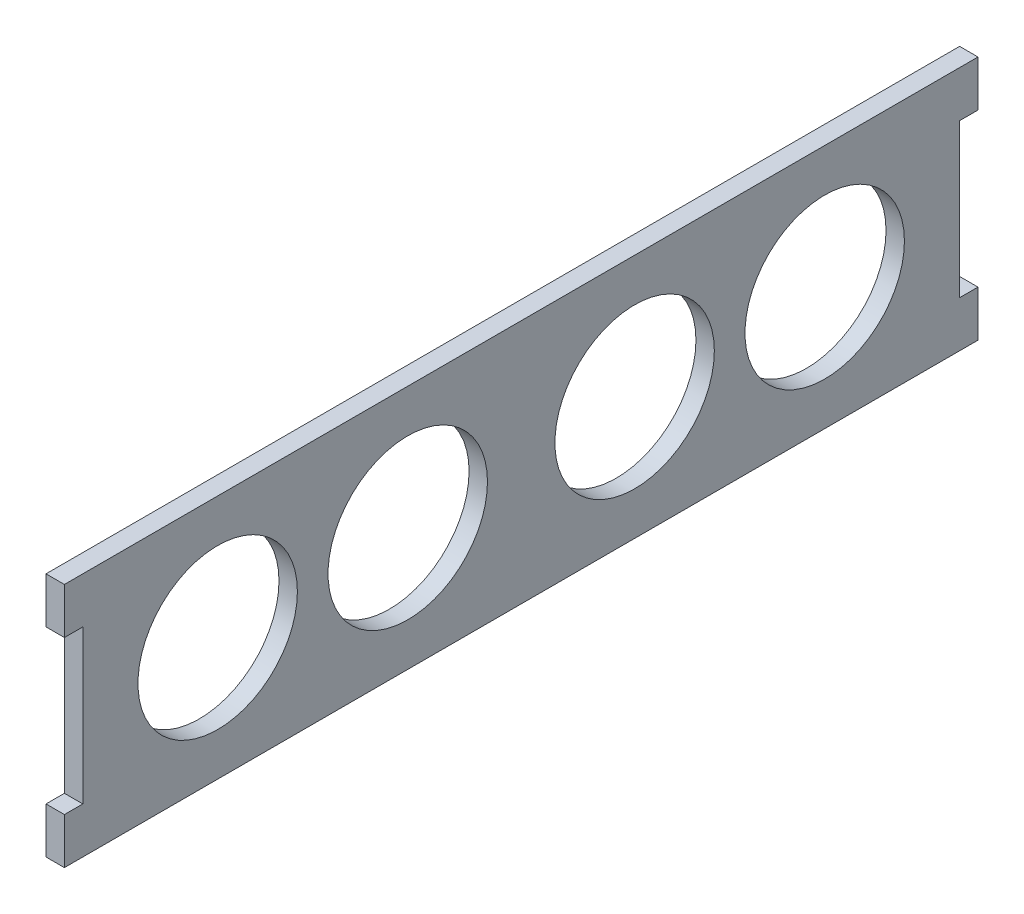
ISO-10303-21;
HEADER;
FILE_DESCRIPTION(('STEP AP214'),'2;1');
FILE_NAME('part.step','',(''),(''),'','','');
FILE_SCHEMA(('AUTOMOTIVE_DESIGN { 1 0 10303 214 1 1 1 1 }'));
ENDSEC;
DATA;
#1=APPLICATION_CONTEXT('core data for automotive mechanical design processes');
#2=APPLICATION_PROTOCOL_DEFINITION('international standard','automotive_design',2000,#1);
#3=PRODUCT_CONTEXT('',#1,'mechanical');
#4=PRODUCT('Part','Part','',(#3));
#5=PRODUCT_RELATED_PRODUCT_CATEGORY('part','',(#4));
#6=PRODUCT_DEFINITION_FORMATION('','',#4);
#7=PRODUCT_DEFINITION_CONTEXT('part definition',#1,'design');
#8=PRODUCT_DEFINITION('design','',#6,#7);
#9=PRODUCT_DEFINITION_SHAPE('','',#8);
#10=(LENGTH_UNIT() NAMED_UNIT(*) SI_UNIT(.MILLI.,.METRE.));
#11=(NAMED_UNIT(*) PLANE_ANGLE_UNIT() SI_UNIT($,.RADIAN.));
#12=(NAMED_UNIT(*) SI_UNIT($,.STERADIAN.) SOLID_ANGLE_UNIT());
#13=UNCERTAINTY_MEASURE_WITH_UNIT(LENGTH_MEASURE(1.E-05),#10,'distance_accuracy_value','');
#14=(GEOMETRIC_REPRESENTATION_CONTEXT(3) GLOBAL_UNCERTAINTY_ASSIGNED_CONTEXT((#13)) GLOBAL_UNIT_ASSIGNED_CONTEXT((#10,
#11,#12)) REPRESENTATION_CONTEXT('',''));
#15=CARTESIAN_POINT('',(0.,0.,0.));
#16=DIRECTION('',(0.,0.,1.));
#17=DIRECTION('',(1.,0.,0.));
#18=AXIS2_PLACEMENT_3D('',#15,#16,#17);
#19=CARTESIAN_POINT('',(3.,0.,71.5));
#20=DIRECTION('',(0.,0.,-1.));
#21=DIRECTION('',(-1.,0.,0.));
#22=AXIS2_PLACEMENT_3D('',#19,#20,#21);
#23=PLANE('',#22);
#24=DIRECTION('',(0.,-1.,0.));
#25=VECTOR('',#24,1.);
#26=CARTESIAN_POINT('',(0.,0.,71.5));
#27=LINE('',#26,#25);
#28=CARTESIAN_POINT('',(0.,12.5,71.5));
#29=VERTEX_POINT('',#28);
#30=CARTESIAN_POINT('',(0.,-12.5,71.5));
#31=VERTEX_POINT('',#30);
#32=EDGE_CURVE('E183',#29,#31,#27,.T.);
#33=ORIENTED_EDGE('',*,*,#32,.T.);
#34=DIRECTION('',(-1.,0.,0.));
#35=VECTOR('',#34,1.);
#36=CARTESIAN_POINT('',(3.,-12.5,71.5));
#37=LINE('',#36,#35);
#38=CARTESIAN_POINT('',(3.,-12.5,71.5));
#39=VERTEX_POINT('',#38);
#40=EDGE_CURVE('E11',#39,#31,#37,.T.);
#41=ORIENTED_EDGE('',*,*,#40,.F.);
#42=DIRECTION('',(0.,-1.,0.));
#43=VECTOR('',#42,1.);
#44=CARTESIAN_POINT('',(3.,0.,71.5));
#45=LINE('',#44,#43);
#46=CARTESIAN_POINT('',(3.,12.5,71.5));
#47=VERTEX_POINT('',#46);
#48=EDGE_CURVE('E108',#47,#39,#45,.T.);
#49=ORIENTED_EDGE('',*,*,#48,.F.);
#50=DIRECTION('',(-1.,0.,0.));
#51=VECTOR('',#50,1.);
#52=CARTESIAN_POINT('',(3.,12.5,71.5));
#53=LINE('',#52,#51);
#54=EDGE_CURVE('E166',#47,#29,#53,.T.);
#55=ORIENTED_EDGE('',*,*,#54,.T.);
#56=EDGE_LOOP('',(#33,#41,#49,#55));
#57=FACE_BOUND('',#56,.T.);
#58=ADVANCED_FACE('F39',(#57),#23,.F.);
#59=CARTESIAN_POINT('',(3.,-12.5,0.));
#60=DIRECTION('',(0.,1.,0.));
#61=DIRECTION('',(0.,0.,1.));
#62=AXIS2_PLACEMENT_3D('',#59,#60,#61);
#63=PLANE('',#62);
#64=DIRECTION('',(0.,0.,-1.));
#65=VECTOR('',#64,1.);
#66=CARTESIAN_POINT('',(0.,-12.5,0.));
#67=LINE('',#66,#65);
#68=CARTESIAN_POINT('',(0.,-12.5,74.5));
#69=VERTEX_POINT('',#68);
#70=EDGE_CURVE('E187',#69,#31,#67,.T.);
#71=ORIENTED_EDGE('',*,*,#70,.F.);
#72=DIRECTION('',(-1.,0.,0.));
#73=VECTOR('',#72,1.);
#74=CARTESIAN_POINT('',(3.,-12.5,74.5));
#75=LINE('',#74,#73);
#76=CARTESIAN_POINT('',(3.,-12.5,74.5));
#77=VERTEX_POINT('',#76);
#78=EDGE_CURVE('E49',#77,#69,#75,.T.);
#79=ORIENTED_EDGE('',*,*,#78,.F.);
#80=DIRECTION('',(0.,0.,-1.));
#81=VECTOR('',#80,1.);
#82=CARTESIAN_POINT('',(3.,-12.5,0.));
#83=LINE('',#82,#81);
#84=EDGE_CURVE('E264',#77,#39,#83,.T.);
#85=ORIENTED_EDGE('',*,*,#84,.T.);
#86=ORIENTED_EDGE('',*,*,#40,.T.);
#87=EDGE_LOOP('',(#71,#79,#85,#86));
#88=FACE_BOUND('',#87,.T.);
#89=ADVANCED_FACE('F263',(#88),#63,.T.);
#90=CARTESIAN_POINT('',(3.,0.,74.5));
#91=DIRECTION('',(0.,0.,-1.));
#92=DIRECTION('',(-1.,0.,0.));
#93=AXIS2_PLACEMENT_3D('',#90,#91,#92);
#94=PLANE('',#93);
#95=DIRECTION('',(0.,-1.,0.));
#96=VECTOR('',#95,1.);
#97=CARTESIAN_POINT('',(0.,0.,74.5));
#98=LINE('',#97,#96);
#99=CARTESIAN_POINT('',(0.,-20.,74.5));
#100=VERTEX_POINT('',#99);
#101=EDGE_CURVE('E191',#69,#100,#98,.T.);
#102=ORIENTED_EDGE('',*,*,#101,.T.);
#103=DIRECTION('',(-1.,0.,0.));
#104=VECTOR('',#103,1.);
#105=CARTESIAN_POINT('',(3.,-20.,74.5));
#106=LINE('',#105,#104);
#107=CARTESIAN_POINT('',(3.,-20.,74.5));
#108=VERTEX_POINT('',#107);
#109=EDGE_CURVE('E246',#108,#100,#106,.T.);
#110=ORIENTED_EDGE('',*,*,#109,.F.);
#111=DIRECTION('',(0.,-1.,0.));
#112=VECTOR('',#111,1.);
#113=CARTESIAN_POINT('',(3.,0.,74.5));
#114=LINE('',#113,#112);
#115=EDGE_CURVE('E255',#77,#108,#114,.T.);
#116=ORIENTED_EDGE('',*,*,#115,.F.);
#117=ORIENTED_EDGE('',*,*,#78,.T.);
#118=EDGE_LOOP('',(#102,#110,#116,#117));
#119=FACE_BOUND('',#118,.T.);
#120=ADVANCED_FACE('F253',(#119),#94,.F.);
#121=CARTESIAN_POINT('',(3.,-20.,0.));
#122=DIRECTION('',(0.,1.,0.));
#123=DIRECTION('',(0.,0.,1.));
#124=AXIS2_PLACEMENT_3D('',#121,#122,#123);
#125=PLANE('',#124);
#126=DIRECTION('',(0.,0.,-1.));
#127=VECTOR('',#126,1.);
#128=CARTESIAN_POINT('',(0.,-20.,0.));
#129=LINE('',#128,#127);
#130=CARTESIAN_POINT('',(0.,-20.,-74.5));
#131=VERTEX_POINT('',#130);
#132=EDGE_CURVE('E194',#100,#131,#129,.T.);
#133=ORIENTED_EDGE('',*,*,#132,.T.);
#134=DIRECTION('',(-1.,0.,0.));
#135=VECTOR('',#134,1.);
#136=CARTESIAN_POINT('',(3.,-20.,-74.5));
#137=LINE('',#136,#135);
#138=CARTESIAN_POINT('',(3.,-20.,-74.5));
#139=VERTEX_POINT('',#138);
#140=EDGE_CURVE('E243',#139,#131,#137,.T.);
#141=ORIENTED_EDGE('',*,*,#140,.F.);
#142=DIRECTION('',(0.,0.,-1.));
#143=VECTOR('',#142,1.);
#144=CARTESIAN_POINT('',(3.,-20.,0.));
#145=LINE('',#144,#143);
#146=EDGE_CURVE('E292',#108,#139,#145,.T.);
#147=ORIENTED_EDGE('',*,*,#146,.F.);
#148=ORIENTED_EDGE('',*,*,#109,.T.);
#149=EDGE_LOOP('',(#133,#141,#147,#148));
#150=FACE_BOUND('',#149,.T.);
#151=ADVANCED_FACE('F291',(#150),#125,.F.);
#152=CARTESIAN_POINT('',(3.,0.,-74.5));
#153=DIRECTION('',(0.,0.,-1.));
#154=DIRECTION('',(-1.,0.,0.));
#155=AXIS2_PLACEMENT_3D('',#152,#153,#154);
#156=PLANE('',#155);
#157=DIRECTION('',(0.,-1.,0.));
#158=VECTOR('',#157,1.);
#159=CARTESIAN_POINT('',(0.,0.,-74.5));
#160=LINE('',#159,#158);
#161=CARTESIAN_POINT('',(0.,-12.5,-74.5));
#162=VERTEX_POINT('',#161);
#163=EDGE_CURVE('E198',#162,#131,#160,.T.);
#164=ORIENTED_EDGE('',*,*,#163,.F.);
#165=DIRECTION('',(-1.,0.,0.));
#166=VECTOR('',#165,1.);
#167=CARTESIAN_POINT('',(3.,-12.5,-74.5));
#168=LINE('',#167,#166);
#169=CARTESIAN_POINT('',(3.,-12.5,-74.5));
#170=VERTEX_POINT('',#169);
#171=EDGE_CURVE('E240',#170,#162,#168,.T.);
#172=ORIENTED_EDGE('',*,*,#171,.F.);
#173=DIRECTION('',(0.,-1.,0.));
#174=VECTOR('',#173,1.);
#175=CARTESIAN_POINT('',(3.,0.,-74.5));
#176=LINE('',#175,#174);
#177=EDGE_CURVE('E288',#170,#139,#176,.T.);
#178=ORIENTED_EDGE('',*,*,#177,.T.);
#179=ORIENTED_EDGE('',*,*,#140,.T.);
#180=EDGE_LOOP('',(#164,#172,#178,#179));
#181=FACE_BOUND('',#180,.T.);
#182=ADVANCED_FACE('F283',(#181),#156,.T.);
#183=CARTESIAN_POINT('',(3.,-12.5,0.));
#184=DIRECTION('',(0.,-1.,0.));
#185=DIRECTION('',(0.,0.,-1.));
#186=AXIS2_PLACEMENT_3D('',#183,#184,#185);
#187=PLANE('',#186);
#188=DIRECTION('',(0.,0.,1.));
#189=VECTOR('',#188,1.);
#190=CARTESIAN_POINT('',(0.,-12.5,0.));
#191=LINE('',#190,#189);
#192=CARTESIAN_POINT('',(0.,-12.5,-71.5));
#193=VERTEX_POINT('',#192);
#194=EDGE_CURVE('E202',#162,#193,#191,.T.);
#195=ORIENTED_EDGE('',*,*,#194,.T.);
#196=DIRECTION('',(-1.,0.,0.));
#197=VECTOR('',#196,1.);
#198=CARTESIAN_POINT('',(3.,-12.5,-71.5));
#199=LINE('',#198,#197);
#200=CARTESIAN_POINT('',(3.,-12.5,-71.5));
#201=VERTEX_POINT('',#200);
#202=EDGE_CURVE('E237',#201,#193,#199,.T.);
#203=ORIENTED_EDGE('',*,*,#202,.F.);
#204=DIRECTION('',(0.,0.,1.));
#205=VECTOR('',#204,1.);
#206=CARTESIAN_POINT('',(3.,-12.5,0.));
#207=LINE('',#206,#205);
#208=EDGE_CURVE('E297',#170,#201,#207,.T.);
#209=ORIENTED_EDGE('',*,*,#208,.F.);
#210=ORIENTED_EDGE('',*,*,#171,.T.);
#211=EDGE_LOOP('',(#195,#203,#209,#210));
#212=FACE_BOUND('',#211,.T.);
#213=ADVANCED_FACE('F307',(#212),#187,.F.);
#214=CARTESIAN_POINT('',(3.,0.,-71.5));
#215=DIRECTION('',(0.,0.,-1.));
#216=DIRECTION('',(-1.,0.,0.));
#217=AXIS2_PLACEMENT_3D('',#214,#215,#216);
#218=PLANE('',#217);
#219=DIRECTION('',(0.,-1.,0.));
#220=VECTOR('',#219,1.);
#221=CARTESIAN_POINT('',(0.,0.,-71.5));
#222=LINE('',#221,#220);
#223=CARTESIAN_POINT('',(0.,12.5,-71.5));
#224=VERTEX_POINT('',#223);
#225=EDGE_CURVE('E206',#224,#193,#222,.T.);
#226=ORIENTED_EDGE('',*,*,#225,.F.);
#227=DIRECTION('',(-1.,0.,0.));
#228=VECTOR('',#227,1.);
#229=CARTESIAN_POINT('',(3.,12.5,-71.5));
#230=LINE('',#229,#228);
#231=CARTESIAN_POINT('',(3.,12.5,-71.5));
#232=VERTEX_POINT('',#231);
#233=EDGE_CURVE('E234',#232,#224,#230,.T.);
#234=ORIENTED_EDGE('',*,*,#233,.F.);
#235=DIRECTION('',(0.,-1.,0.));
#236=VECTOR('',#235,1.);
#237=CARTESIAN_POINT('',(3.,0.,-71.5));
#238=LINE('',#237,#236);
#239=EDGE_CURVE('E304',#232,#201,#238,.T.);
#240=ORIENTED_EDGE('',*,*,#239,.T.);
#241=ORIENTED_EDGE('',*,*,#202,.T.);
#242=EDGE_LOOP('',(#226,#234,#240,#241));
#243=FACE_BOUND('',#242,.T.);
#244=ADVANCED_FACE('F277',(#243),#218,.T.);
#245=CARTESIAN_POINT('',(3.,12.5,0.));
#246=DIRECTION('',(0.,-1.,0.));
#247=DIRECTION('',(0.,0.,-1.));
#248=AXIS2_PLACEMENT_3D('',#245,#246,#247);
#249=PLANE('',#248);
#250=DIRECTION('',(0.,0.,1.));
#251=VECTOR('',#250,1.);
#252=CARTESIAN_POINT('',(0.,12.5,0.));
#253=LINE('',#252,#251);
#254=CARTESIAN_POINT('',(0.,12.5,-74.5));
#255=VERTEX_POINT('',#254);
#256=EDGE_CURVE('E210',#255,#224,#253,.T.);
#257=ORIENTED_EDGE('',*,*,#256,.F.);
#258=DIRECTION('',(-1.,0.,0.));
#259=VECTOR('',#258,1.);
#260=CARTESIAN_POINT('',(3.,12.5,-74.5));
#261=LINE('',#260,#259);
#262=CARTESIAN_POINT('',(3.,12.5,-74.5));
#263=VERTEX_POINT('',#262);
#264=EDGE_CURVE('E231',#263,#255,#261,.T.);
#265=ORIENTED_EDGE('',*,*,#264,.F.);
#266=DIRECTION('',(0.,0.,1.));
#267=VECTOR('',#266,1.);
#268=CARTESIAN_POINT('',(3.,12.5,0.));
#269=LINE('',#268,#267);
#270=EDGE_CURVE('E160',#263,#232,#269,.T.);
#271=ORIENTED_EDGE('',*,*,#270,.T.);
#272=ORIENTED_EDGE('',*,*,#233,.T.);
#273=EDGE_LOOP('',(#257,#265,#271,#272));
#274=FACE_BOUND('',#273,.T.);
#275=ADVANCED_FACE('F272',(#274),#249,.T.);
#276=CARTESIAN_POINT('',(3.,0.,-74.5));
#277=DIRECTION('',(0.,0.,-1.));
#278=DIRECTION('',(-1.,0.,0.));
#279=AXIS2_PLACEMENT_3D('',#276,#277,#278);
#280=PLANE('',#279);
#281=DIRECTION('',(0.,-1.,0.));
#282=VECTOR('',#281,1.);
#283=CARTESIAN_POINT('',(0.,0.,-74.5));
#284=LINE('',#283,#282);
#285=CARTESIAN_POINT('',(0.,20.,-74.5));
#286=VERTEX_POINT('',#285);
#287=EDGE_CURVE('E214',#286,#255,#284,.T.);
#288=ORIENTED_EDGE('',*,*,#287,.F.);
#289=DIRECTION('',(-1.,0.,0.));
#290=VECTOR('',#289,1.);
#291=CARTESIAN_POINT('',(3.,20.,-74.5));
#292=LINE('',#291,#290);
#293=CARTESIAN_POINT('',(3.,20.,-74.5));
#294=VERTEX_POINT('',#293);
#295=EDGE_CURVE('E145',#294,#286,#292,.T.);
#296=ORIENTED_EDGE('',*,*,#295,.F.);
#297=DIRECTION('',(0.,-1.,0.));
#298=VECTOR('',#297,1.);
#299=CARTESIAN_POINT('',(3.,0.,-74.5));
#300=LINE('',#299,#298);
#301=EDGE_CURVE('E156',#294,#263,#300,.T.);
#302=ORIENTED_EDGE('',*,*,#301,.T.);
#303=ORIENTED_EDGE('',*,*,#264,.T.);
#304=EDGE_LOOP('',(#288,#296,#302,#303));
#305=FACE_BOUND('',#304,.T.);
#306=ADVANCED_FACE('F269',(#305),#280,.T.);
#307=CARTESIAN_POINT('',(3.,20.,0.));
#308=DIRECTION('',(0.,1.,0.));
#309=DIRECTION('',(0.,0.,1.));
#310=AXIS2_PLACEMENT_3D('',#307,#308,#309);
#311=PLANE('',#310);
#312=DIRECTION('',(0.,0.,-1.));
#313=VECTOR('',#312,1.);
#314=CARTESIAN_POINT('',(0.,20.,0.));
#315=LINE('',#314,#313);
#316=CARTESIAN_POINT('',(0.,20.,74.5));
#317=VERTEX_POINT('',#316);
#318=EDGE_CURVE('E143',#317,#286,#315,.T.);
#319=ORIENTED_EDGE('',*,*,#318,.F.);
#320=DIRECTION('',(-1.,0.,0.));
#321=VECTOR('',#320,1.);
#322=CARTESIAN_POINT('',(3.,20.,74.5));
#323=LINE('',#322,#321);
#324=CARTESIAN_POINT('',(3.,20.,74.5));
#325=VERTEX_POINT('',#324);
#326=EDGE_CURVE('E137',#325,#317,#323,.T.);
#327=ORIENTED_EDGE('',*,*,#326,.F.);
#328=DIRECTION('',(0.,0.,-1.));
#329=VECTOR('',#328,1.);
#330=CARTESIAN_POINT('',(3.,20.,0.));
#331=LINE('',#330,#329);
#332=EDGE_CURVE('E141',#325,#294,#331,.T.);
#333=ORIENTED_EDGE('',*,*,#332,.T.);
#334=ORIENTED_EDGE('',*,*,#295,.T.);
#335=EDGE_LOOP('',(#319,#327,#333,#334));
#336=FACE_BOUND('',#335,.T.);
#337=ADVANCED_FACE('F139',(#336),#311,.T.);
#338=CARTESIAN_POINT('',(3.,0.,74.5));
#339=DIRECTION('',(0.,0.,-1.));
#340=DIRECTION('',(-1.,0.,0.));
#341=AXIS2_PLACEMENT_3D('',#338,#339,#340);
#342=PLANE('',#341);
#343=DIRECTION('',(0.,-1.,0.));
#344=VECTOR('',#343,1.);
#345=CARTESIAN_POINT('',(0.,0.,74.5));
#346=LINE('',#345,#344);
#347=CARTESIAN_POINT('',(0.,12.5,74.5));
#348=VERTEX_POINT('',#347);
#349=EDGE_CURVE('E96',#317,#348,#346,.T.);
#350=ORIENTED_EDGE('',*,*,#349,.T.);
#351=DIRECTION('',(-1.,0.,0.));
#352=VECTOR('',#351,1.);
#353=CARTESIAN_POINT('',(3.,12.5,74.5));
#354=LINE('',#353,#352);
#355=CARTESIAN_POINT('',(3.,12.5,74.5));
#356=VERTEX_POINT('',#355);
#357=EDGE_CURVE('E146',#356,#348,#354,.T.);
#358=ORIENTED_EDGE('',*,*,#357,.F.);
#359=DIRECTION('',(0.,-1.,0.));
#360=VECTOR('',#359,1.);
#361=CARTESIAN_POINT('',(3.,0.,74.5));
#362=LINE('',#361,#360);
#363=EDGE_CURVE('E148',#325,#356,#362,.T.);
#364=ORIENTED_EDGE('',*,*,#363,.F.);
#365=ORIENTED_EDGE('',*,*,#326,.T.);
#366=EDGE_LOOP('',(#350,#358,#364,#365));
#367=FACE_BOUND('',#366,.T.);
#368=ADVANCED_FACE('F149',(#367),#342,.F.);
#369=CARTESIAN_POINT('',(3.,0.,-49.5));
#370=DIRECTION('',(-1.,0.,0.));
#371=DIRECTION('',(0.,0.,1.));
#372=AXIS2_PLACEMENT_3D('',#369,#370,#371);
#373=CYLINDRICAL_SURFACE('',#372,13.);
#374=CARTESIAN_POINT('',(3.,0.,-49.5));
#375=DIRECTION('',(1.,0.,0.));
#376=DIRECTION('',(0.,0.,-1.));
#377=AXIS2_PLACEMENT_3D('',#374,#375,#376);
#378=CIRCLE('',#377,13.);
#379=CARTESIAN_POINT('',(3.,0.,-62.5));
#380=VERTEX_POINT('',#379);
#381=EDGE_CURVE('E490',#380,#380,#378,.T.);
#382=ORIENTED_EDGE('',*,*,#381,.T.);
#383=EDGE_LOOP('',(#382));
#384=FACE_BOUND('',#383,.T.);
#385=CARTESIAN_POINT('',(0.,0.,-49.5));
#386=DIRECTION('',(1.,0.,0.));
#387=DIRECTION('',(0.,0.,-1.));
#388=AXIS2_PLACEMENT_3D('',#385,#386,#387);
#389=CIRCLE('',#388,13.);
#390=CARTESIAN_POINT('',(0.,0.,-62.5));
#391=VERTEX_POINT('',#390);
#392=EDGE_CURVE('E179',#391,#391,#389,.T.);
#393=ORIENTED_EDGE('',*,*,#392,.F.);
#394=EDGE_LOOP('',(#393));
#395=FACE_BOUND('',#394,.T.);
#396=ADVANCED_FACE('F324',(#384,#395),#373,.F.);
#397=CARTESIAN_POINT('',(3.,0.,-18.5));
#398=DIRECTION('',(-1.,0.,0.));
#399=DIRECTION('',(0.,0.,1.));
#400=AXIS2_PLACEMENT_3D('',#397,#398,#399);
#401=CYLINDRICAL_SURFACE('',#400,13.);
#402=CARTESIAN_POINT('',(3.,0.,-18.5));
#403=DIRECTION('',(1.,0.,0.));
#404=DIRECTION('',(0.,0.,-1.));
#405=AXIS2_PLACEMENT_3D('',#402,#403,#404);
#406=CIRCLE('',#405,13.);
#407=CARTESIAN_POINT('',(3.,0.,-31.5));
#408=VERTEX_POINT('',#407);
#409=EDGE_CURVE('E487',#408,#408,#406,.T.);
#410=ORIENTED_EDGE('',*,*,#409,.T.);
#411=EDGE_LOOP('',(#410));
#412=FACE_BOUND('',#411,.T.);
#413=CARTESIAN_POINT('',(0.,0.,-18.5));
#414=DIRECTION('',(1.,0.,0.));
#415=DIRECTION('',(0.,0.,-1.));
#416=AXIS2_PLACEMENT_3D('',#413,#414,#415);
#417=CIRCLE('',#416,13.);
#418=CARTESIAN_POINT('',(0.,0.,-31.5));
#419=VERTEX_POINT('',#418);
#420=EDGE_CURVE('E175',#419,#419,#417,.T.);
#421=ORIENTED_EDGE('',*,*,#420,.F.);
#422=EDGE_LOOP('',(#421));
#423=FACE_BOUND('',#422,.T.);
#424=ADVANCED_FACE('F327',(#412,#423),#401,.F.);
#425=CARTESIAN_POINT('',(3.,0.,18.5));
#426=DIRECTION('',(-1.,0.,0.));
#427=DIRECTION('',(0.,0.,1.));
#428=AXIS2_PLACEMENT_3D('',#425,#426,#427);
#429=CYLINDRICAL_SURFACE('',#428,13.);
#430=CARTESIAN_POINT('',(3.,0.,18.5));
#431=DIRECTION('',(1.,0.,0.));
#432=DIRECTION('',(0.,0.,-1.));
#433=AXIS2_PLACEMENT_3D('',#430,#431,#432);
#434=CIRCLE('',#433,13.);
#435=CARTESIAN_POINT('',(3.,0.,5.49999999999998));
#436=VERTEX_POINT('',#435);
#437=EDGE_CURVE('E342',#436,#436,#434,.T.);
#438=ORIENTED_EDGE('',*,*,#437,.T.);
#439=EDGE_LOOP('',(#438));
#440=FACE_BOUND('',#439,.T.);
#441=CARTESIAN_POINT('',(0.,0.,18.5));
#442=DIRECTION('',(1.,0.,0.));
#443=DIRECTION('',(0.,0.,-1.));
#444=AXIS2_PLACEMENT_3D('',#441,#442,#443);
#445=CIRCLE('',#444,13.);
#446=CARTESIAN_POINT('',(0.,0.,5.49999999999998));
#447=VERTEX_POINT('',#446);
#448=EDGE_CURVE('E171',#447,#447,#445,.T.);
#449=ORIENTED_EDGE('',*,*,#448,.F.);
#450=EDGE_LOOP('',(#449));
#451=FACE_BOUND('',#450,.T.);
#452=ADVANCED_FACE('F330',(#440,#451),#429,.F.);
#453=CARTESIAN_POINT('',(3.,0.,49.5));
#454=DIRECTION('',(-1.,0.,0.));
#455=DIRECTION('',(0.,0.,1.));
#456=AXIS2_PLACEMENT_3D('',#453,#454,#455);
#457=CYLINDRICAL_SURFACE('',#456,13.);
#458=CARTESIAN_POINT('',(3.,0.,49.5));
#459=DIRECTION('',(1.,0.,0.));
#460=DIRECTION('',(0.,0.,-1.));
#461=AXIS2_PLACEMENT_3D('',#458,#459,#460);
#462=CIRCLE('',#461,13.);
#463=CARTESIAN_POINT('',(3.,0.,36.5));
#464=VERTEX_POINT('',#463);
#465=EDGE_CURVE('E224',#464,#464,#462,.T.);
#466=ORIENTED_EDGE('',*,*,#465,.T.);
#467=EDGE_LOOP('',(#466));
#468=FACE_BOUND('',#467,.T.);
#469=CARTESIAN_POINT('',(0.,0.,49.5));
#470=DIRECTION('',(1.,0.,0.));
#471=DIRECTION('',(0.,0.,-1.));
#472=AXIS2_PLACEMENT_3D('',#469,#470,#471);
#473=CIRCLE('',#472,13.);
#474=CARTESIAN_POINT('',(0.,0.,36.5));
#475=VERTEX_POINT('',#474);
#476=EDGE_CURVE('E167',#475,#475,#473,.T.);
#477=ORIENTED_EDGE('',*,*,#476,.F.);
#478=EDGE_LOOP('',(#477));
#479=FACE_BOUND('',#478,.T.);
#480=ADVANCED_FACE('F41',(#468,#479),#457,.F.);
#481=CARTESIAN_POINT('',(3.,12.5,0.));
#482=DIRECTION('',(0.,1.,0.));
#483=DIRECTION('',(0.,0.,1.));
#484=AXIS2_PLACEMENT_3D('',#481,#482,#483);
#485=PLANE('',#484);
#486=DIRECTION('',(0.,0.,-1.));
#487=VECTOR('',#486,1.);
#488=CARTESIAN_POINT('',(0.,12.5,0.));
#489=LINE('',#488,#487);
#490=EDGE_CURVE('E102',#348,#29,#489,.T.);
#491=ORIENTED_EDGE('',*,*,#490,.T.);
#492=ORIENTED_EDGE('',*,*,#54,.F.);
#493=DIRECTION('',(0.,0.,-1.));
#494=VECTOR('',#493,1.);
#495=CARTESIAN_POINT('',(3.,12.5,0.));
#496=LINE('',#495,#494);
#497=EDGE_CURVE('E57',#356,#47,#496,.T.);
#498=ORIENTED_EDGE('',*,*,#497,.F.);
#499=ORIENTED_EDGE('',*,*,#357,.T.);
#500=EDGE_LOOP('',(#491,#492,#498,#499));
#501=FACE_BOUND('',#500,.T.);
#502=ADVANCED_FACE('F337',(#501),#485,.F.);
#503=CARTESIAN_POINT('',(3.,0.,0.));
#504=DIRECTION('',(1.,0.,0.));
#505=DIRECTION('',(0.,0.,-1.));
#506=AXIS2_PLACEMENT_3D('',#503,#504,#505);
#507=PLANE('',#506);
#508=ORIENTED_EDGE('',*,*,#465,.F.);
#509=EDGE_LOOP('',(#508));
#510=FACE_BOUND('',#509,.T.);
#511=ORIENTED_EDGE('',*,*,#437,.F.);
#512=EDGE_LOOP('',(#511));
#513=FACE_BOUND('',#512,.T.);
#514=ORIENTED_EDGE('',*,*,#409,.F.);
#515=EDGE_LOOP('',(#514));
#516=FACE_BOUND('',#515,.T.);
#517=ORIENTED_EDGE('',*,*,#381,.F.);
#518=EDGE_LOOP('',(#517));
#519=FACE_BOUND('',#518,.T.);
#520=ORIENTED_EDGE('',*,*,#48,.T.);
#521=ORIENTED_EDGE('',*,*,#84,.F.);
#522=ORIENTED_EDGE('',*,*,#115,.T.);
#523=ORIENTED_EDGE('',*,*,#146,.T.);
#524=ORIENTED_EDGE('',*,*,#177,.F.);
#525=ORIENTED_EDGE('',*,*,#208,.T.);
#526=ORIENTED_EDGE('',*,*,#239,.F.);
#527=ORIENTED_EDGE('',*,*,#270,.F.);
#528=ORIENTED_EDGE('',*,*,#301,.F.);
#529=ORIENTED_EDGE('',*,*,#332,.F.);
#530=ORIENTED_EDGE('',*,*,#363,.T.);
#531=ORIENTED_EDGE('',*,*,#497,.T.);
#532=EDGE_LOOP('',(#520,#521,#522,#523,#524,#525,#526,#527,#528,#529,#530,#531));
#533=FACE_BOUND('',#532,.T.);
#534=ADVANCED_FACE('F153',(#510,#513,#516,#519,#533),#507,.T.);
#535=CARTESIAN_POINT('',(0.,0.,0.));
#536=DIRECTION('',(1.,0.,0.));
#537=DIRECTION('',(0.,0.,-1.));
#538=AXIS2_PLACEMENT_3D('',#535,#536,#537);
#539=PLANE('',#538);
#540=ORIENTED_EDGE('',*,*,#476,.T.);
#541=EDGE_LOOP('',(#540));
#542=FACE_BOUND('',#541,.T.);
#543=ORIENTED_EDGE('',*,*,#448,.T.);
#544=EDGE_LOOP('',(#543));
#545=FACE_BOUND('',#544,.T.);
#546=ORIENTED_EDGE('',*,*,#420,.T.);
#547=EDGE_LOOP('',(#546));
#548=FACE_BOUND('',#547,.T.);
#549=ORIENTED_EDGE('',*,*,#392,.T.);
#550=EDGE_LOOP('',(#549));
#551=FACE_BOUND('',#550,.T.);
#552=ORIENTED_EDGE('',*,*,#32,.F.);
#553=ORIENTED_EDGE('',*,*,#490,.F.);
#554=ORIENTED_EDGE('',*,*,#349,.F.);
#555=ORIENTED_EDGE('',*,*,#318,.T.);
#556=ORIENTED_EDGE('',*,*,#287,.T.);
#557=ORIENTED_EDGE('',*,*,#256,.T.);
#558=ORIENTED_EDGE('',*,*,#225,.T.);
#559=ORIENTED_EDGE('',*,*,#194,.F.);
#560=ORIENTED_EDGE('',*,*,#163,.T.);
#561=ORIENTED_EDGE('',*,*,#132,.F.);
#562=ORIENTED_EDGE('',*,*,#101,.F.);
#563=ORIENTED_EDGE('',*,*,#70,.T.);
#564=EDGE_LOOP('',(#552,#553,#554,#555,#556,#557,#558,#559,#560,#561,#562,#563));
#565=FACE_BOUND('',#564,.T.);
#566=ADVANCED_FACE('F262',(#542,#545,#548,#551,#565),#539,.F.);
#567=CLOSED_SHELL('',(#58,#89,#120,#151,#182,#213,#244,#275,#306,#337,#368,#396,#424,#452,#480,
#502,#534,#566));
#568=MANIFOLD_SOLID_BREP('B2',#567);
#569=ADVANCED_BREP_SHAPE_REPRESENTATION('',(#18,#568),#14);
#570=SHAPE_DEFINITION_REPRESENTATION(#9,#569);
ENDSEC;
END-ISO-10303-21;
